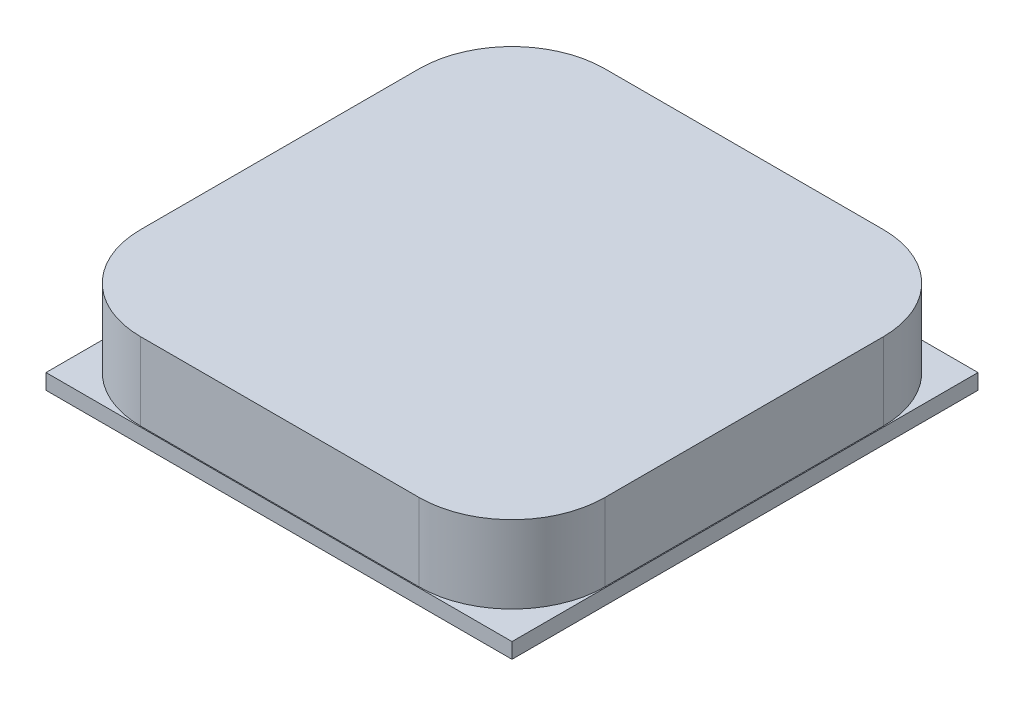
ISO-10303-21;
HEADER;
FILE_DESCRIPTION(('STEP AP214'),'2;1');
FILE_NAME('part.step','',(''),(''),'','','');
FILE_SCHEMA(('AUTOMOTIVE_DESIGN { 1 0 10303 214 1 1 1 1 }'));
ENDSEC;
DATA;
#1=APPLICATION_CONTEXT('core data for automotive mechanical design processes');
#2=APPLICATION_PROTOCOL_DEFINITION('international standard','automotive_design',2000,#1);
#3=PRODUCT_CONTEXT('',#1,'mechanical');
#4=PRODUCT('Part','Part','',(#3));
#5=PRODUCT_RELATED_PRODUCT_CATEGORY('part','',(#4));
#6=PRODUCT_DEFINITION_FORMATION('','',#4);
#7=PRODUCT_DEFINITION_CONTEXT('part definition',#1,'design');
#8=PRODUCT_DEFINITION('design','',#6,#7);
#9=PRODUCT_DEFINITION_SHAPE('','',#8);
#10=(LENGTH_UNIT() NAMED_UNIT(*) SI_UNIT(.MILLI.,.METRE.));
#11=(NAMED_UNIT(*) PLANE_ANGLE_UNIT() SI_UNIT($,.RADIAN.));
#12=(NAMED_UNIT(*) SI_UNIT($,.STERADIAN.) SOLID_ANGLE_UNIT());
#13=UNCERTAINTY_MEASURE_WITH_UNIT(LENGTH_MEASURE(1.E-05),#10,'distance_accuracy_value','');
#14=(GEOMETRIC_REPRESENTATION_CONTEXT(3) GLOBAL_UNCERTAINTY_ASSIGNED_CONTEXT((#13)) GLOBAL_UNIT_ASSIGNED_CONTEXT((#10,
#11,#12)) REPRESENTATION_CONTEXT('',''));
#15=CARTESIAN_POINT('',(0.,0.,0.));
#16=DIRECTION('',(0.,0.,1.));
#17=DIRECTION('',(1.,0.,0.));
#18=AXIS2_PLACEMENT_3D('',#15,#16,#17);
#19=CARTESIAN_POINT('',(0.,0.83,0.));
#20=DIRECTION('',(0.,-1.,0.));
#21=DIRECTION('',(0.,0.,-1.));
#22=AXIS2_PLACEMENT_3D('',#19,#20,#21);
#23=PLANE('',#22);
#24=DIRECTION('',(0.,0.,-1.));
#25=VECTOR('',#24,1.);
#26=CARTESIAN_POINT('',(12.55,0.83,12.55));
#27=LINE('',#26,#25);
#28=CARTESIAN_POINT('',(12.55,0.83,12.55));
#29=VERTEX_POINT('',#28);
#30=CARTESIAN_POINT('',(12.55,0.83,-12.55));
#31=VERTEX_POINT('',#30);
#32=EDGE_CURVE('E281',#29,#31,#27,.T.);
#33=ORIENTED_EDGE('',*,*,#32,.T.);
#34=DIRECTION('',(-1.,0.,0.));
#35=VECTOR('',#34,1.);
#36=CARTESIAN_POINT('',(-12.55,0.83,-12.55));
#37=LINE('',#36,#35);
#38=CARTESIAN_POINT('',(-12.55,0.83,-12.55));
#39=VERTEX_POINT('',#38);
#40=EDGE_CURVE('E284',#31,#39,#37,.T.);
#41=ORIENTED_EDGE('',*,*,#40,.T.);
#42=DIRECTION('',(0.,0.,1.));
#43=VECTOR('',#42,1.);
#44=CARTESIAN_POINT('',(-12.55,0.83,12.55));
#45=LINE('',#44,#43);
#46=CARTESIAN_POINT('',(-12.55,0.83,12.55));
#47=VERTEX_POINT('',#46);
#48=EDGE_CURVE('E287',#39,#47,#45,.T.);
#49=ORIENTED_EDGE('',*,*,#48,.T.);
#50=DIRECTION('',(1.,0.,0.));
#51=VECTOR('',#50,1.);
#52=CARTESIAN_POINT('',(-12.55,0.83,12.55));
#53=LINE('',#52,#51);
#54=EDGE_CURVE('E289',#47,#29,#53,.T.);
#55=ORIENTED_EDGE('',*,*,#54,.T.);
#56=EDGE_LOOP('',(#33,#41,#49,#55));
#57=FACE_BOUND('',#56,.T.);
#58=DIRECTION('',(0.,0.,-1.));
#59=VECTOR('',#58,1.);
#60=CARTESIAN_POINT('',(12.5,0.83,0.));
#61=LINE('',#60,#59);
#62=CARTESIAN_POINT('',(12.5,0.83,7.5));
#63=VERTEX_POINT('',#62);
#64=CARTESIAN_POINT('',(12.5,0.83,-7.5));
#65=VERTEX_POINT('',#64);
#66=EDGE_CURVE('E277',#63,#65,#61,.T.);
#67=ORIENTED_EDGE('',*,*,#66,.F.);
#68=CARTESIAN_POINT('',(7.5,0.83,7.5));
#69=DIRECTION('',(0.,-1.,0.));
#70=DIRECTION('',(0.,0.,-1.));
#71=AXIS2_PLACEMENT_3D('',#68,#69,#70);
#72=CIRCLE('',#71,5.);
#73=CARTESIAN_POINT('',(7.5,0.83,12.5));
#74=VERTEX_POINT('',#73);
#75=EDGE_CURVE('E342',#63,#74,#72,.T.);
#76=ORIENTED_EDGE('',*,*,#75,.T.);
#77=DIRECTION('',(1.,0.,0.));
#78=VECTOR('',#77,1.);
#79=CARTESIAN_POINT('',(0.,0.83,12.5));
#80=LINE('',#79,#78);
#81=CARTESIAN_POINT('',(-7.5,0.83,12.5));
#82=VERTEX_POINT('',#81);
#83=EDGE_CURVE('E268',#82,#74,#80,.T.);
#84=ORIENTED_EDGE('',*,*,#83,.F.);
#85=CARTESIAN_POINT('',(-7.5,0.83,7.5));
#86=DIRECTION('',(0.,-1.,0.));
#87=DIRECTION('',(0.,0.,-1.));
#88=AXIS2_PLACEMENT_3D('',#85,#86,#87);
#89=CIRCLE('',#88,5.);
#90=CARTESIAN_POINT('',(-12.5,0.83,7.5));
#91=VERTEX_POINT('',#90);
#92=EDGE_CURVE('E344',#82,#91,#89,.T.);
#93=ORIENTED_EDGE('',*,*,#92,.T.);
#94=DIRECTION('',(0.,0.,1.));
#95=VECTOR('',#94,1.);
#96=CARTESIAN_POINT('',(-12.5,0.83,0.));
#97=LINE('',#96,#95);
#98=CARTESIAN_POINT('',(-12.5,0.83,-7.5));
#99=VERTEX_POINT('',#98);
#100=EDGE_CURVE('E271',#99,#91,#97,.T.);
#101=ORIENTED_EDGE('',*,*,#100,.F.);
#102=CARTESIAN_POINT('',(-7.5,0.83,-7.5));
#103=DIRECTION('',(0.,-1.,0.));
#104=DIRECTION('',(0.,0.,-1.));
#105=AXIS2_PLACEMENT_3D('',#102,#103,#104);
#106=CIRCLE('',#105,5.);
#107=CARTESIAN_POINT('',(-7.5,0.83,-12.5));
#108=VERTEX_POINT('',#107);
#109=EDGE_CURVE('E338',#99,#108,#106,.T.);
#110=ORIENTED_EDGE('',*,*,#109,.T.);
#111=DIRECTION('',(-1.,0.,0.));
#112=VECTOR('',#111,1.);
#113=CARTESIAN_POINT('',(0.,0.83,-12.5));
#114=LINE('',#113,#112);
#115=CARTESIAN_POINT('',(7.5,0.83,-12.5));
#116=VERTEX_POINT('',#115);
#117=EDGE_CURVE('E274',#116,#108,#114,.T.);
#118=ORIENTED_EDGE('',*,*,#117,.F.);
#119=CARTESIAN_POINT('',(7.5,0.83,-7.5));
#120=DIRECTION('',(0.,-1.,0.));
#121=DIRECTION('',(0.,0.,-1.));
#122=AXIS2_PLACEMENT_3D('',#119,#120,#121);
#123=CIRCLE('',#122,5.);
#124=EDGE_CURVE('E340',#116,#65,#123,.T.);
#125=ORIENTED_EDGE('',*,*,#124,.T.);
#126=EDGE_LOOP('',(#67,#76,#84,#93,#101,#110,#118,#125));
#127=FACE_BOUND('',#126,.T.);
#128=ADVANCED_FACE('F42',(#57,#127),#23,.F.);
#129=CARTESIAN_POINT('',(12.55,0.83,12.55));
#130=DIRECTION('',(-1.,0.,0.));
#131=DIRECTION('',(0.,0.,1.));
#132=AXIS2_PLACEMENT_3D('',#129,#130,#131);
#133=PLANE('',#132);
#134=DIRECTION('',(0.,0.,-1.));
#135=VECTOR('',#134,1.);
#136=CARTESIAN_POINT('',(12.55,0.,12.55));
#137=LINE('',#136,#135);
#138=CARTESIAN_POINT('',(12.55,0.,12.55));
#139=VERTEX_POINT('',#138);
#140=CARTESIAN_POINT('',(12.55,0.,-12.55));
#141=VERTEX_POINT('',#140);
#142=EDGE_CURVE('E280',#139,#141,#137,.T.);
#143=ORIENTED_EDGE('',*,*,#142,.T.);
#144=DIRECTION('',(0.,-1.,0.));
#145=VECTOR('',#144,1.);
#146=CARTESIAN_POINT('',(12.55,0.83,-12.55));
#147=LINE('',#146,#145);
#148=EDGE_CURVE('E307',#31,#141,#147,.T.);
#149=ORIENTED_EDGE('',*,*,#148,.F.);
#150=ORIENTED_EDGE('',*,*,#32,.F.);
#151=DIRECTION('',(0.,-1.,0.));
#152=VECTOR('',#151,1.);
#153=CARTESIAN_POINT('',(12.55,0.83,12.55));
#154=LINE('',#153,#152);
#155=EDGE_CURVE('E291',#29,#139,#154,.T.);
#156=ORIENTED_EDGE('',*,*,#155,.T.);
#157=EDGE_LOOP('',(#143,#149,#150,#156));
#158=FACE_BOUND('',#157,.T.);
#159=ADVANCED_FACE('F393',(#158),#133,.F.);
#160=CARTESIAN_POINT('',(-12.55,0.83,-12.55));
#161=DIRECTION('',(0.,0.,1.));
#162=DIRECTION('',(1.,0.,0.));
#163=AXIS2_PLACEMENT_3D('',#160,#161,#162);
#164=PLANE('',#163);
#165=DIRECTION('',(-1.,0.,0.));
#166=VECTOR('',#165,1.);
#167=CARTESIAN_POINT('',(-12.55,0.,-12.55));
#168=LINE('',#167,#166);
#169=CARTESIAN_POINT('',(-12.55,0.,-12.55));
#170=VERTEX_POINT('',#169);
#171=EDGE_CURVE('E294',#141,#170,#168,.T.);
#172=ORIENTED_EDGE('',*,*,#171,.T.);
#173=DIRECTION('',(0.,-1.,0.));
#174=VECTOR('',#173,1.);
#175=CARTESIAN_POINT('',(-12.55,0.83,-12.55));
#176=LINE('',#175,#174);
#177=EDGE_CURVE('E304',#39,#170,#176,.T.);
#178=ORIENTED_EDGE('',*,*,#177,.F.);
#179=ORIENTED_EDGE('',*,*,#40,.F.);
#180=ORIENTED_EDGE('',*,*,#148,.T.);
#181=EDGE_LOOP('',(#172,#178,#179,#180));
#182=FACE_BOUND('',#181,.T.);
#183=ADVANCED_FACE('F399',(#182),#164,.F.);
#184=CARTESIAN_POINT('',(-12.55,0.83,12.55));
#185=DIRECTION('',(1.,0.,0.));
#186=DIRECTION('',(0.,0.,-1.));
#187=AXIS2_PLACEMENT_3D('',#184,#185,#186);
#188=PLANE('',#187);
#189=DIRECTION('',(0.,0.,1.));
#190=VECTOR('',#189,1.);
#191=CARTESIAN_POINT('',(-12.55,0.,12.55));
#192=LINE('',#191,#190);
#193=CARTESIAN_POINT('',(-12.55,0.,12.55));
#194=VERTEX_POINT('',#193);
#195=EDGE_CURVE('E296',#170,#194,#192,.T.);
#196=ORIENTED_EDGE('',*,*,#195,.T.);
#197=DIRECTION('',(0.,-1.,0.));
#198=VECTOR('',#197,1.);
#199=CARTESIAN_POINT('',(-12.55,0.83,12.55));
#200=LINE('',#199,#198);
#201=EDGE_CURVE('E301',#47,#194,#200,.T.);
#202=ORIENTED_EDGE('',*,*,#201,.F.);
#203=ORIENTED_EDGE('',*,*,#48,.F.);
#204=ORIENTED_EDGE('',*,*,#177,.T.);
#205=EDGE_LOOP('',(#196,#202,#203,#204));
#206=FACE_BOUND('',#205,.T.);
#207=ADVANCED_FACE('F412',(#206),#188,.F.);
#208=CARTESIAN_POINT('',(-12.55,0.83,12.55));
#209=DIRECTION('',(0.,0.,-1.));
#210=DIRECTION('',(-1.,0.,0.));
#211=AXIS2_PLACEMENT_3D('',#208,#209,#210);
#212=PLANE('',#211);
#213=DIRECTION('',(1.,0.,0.));
#214=VECTOR('',#213,1.);
#215=CARTESIAN_POINT('',(-12.55,0.,12.55));
#216=LINE('',#215,#214);
#217=EDGE_CURVE('E285',#194,#139,#216,.T.);
#218=ORIENTED_EDGE('',*,*,#217,.T.);
#219=ORIENTED_EDGE('',*,*,#155,.F.);
#220=ORIENTED_EDGE('',*,*,#54,.F.);
#221=ORIENTED_EDGE('',*,*,#201,.T.);
#222=EDGE_LOOP('',(#218,#219,#220,#221));
#223=FACE_BOUND('',#222,.T.);
#224=ADVANCED_FACE('F409',(#223),#212,.F.);
#225=CARTESIAN_POINT('',(0.,0.,0.));
#226=DIRECTION('',(0.,-1.,0.));
#227=DIRECTION('',(0.,0.,-1.));
#228=AXIS2_PLACEMENT_3D('',#225,#226,#227);
#229=PLANE('',#228);
#230=DIRECTION('',(0.,0.,1.));
#231=VECTOR('',#230,1.);
#232=CARTESIAN_POINT('',(8.,0.,0.));
#233=LINE('',#232,#231);
#234=CARTESIAN_POINT('',(8.,0.,-7.50000000000001));
#235=VERTEX_POINT('',#234);
#236=CARTESIAN_POINT('',(8.,0.,-1.5));
#237=VERTEX_POINT('',#236);
#238=EDGE_CURVE('E238',#235,#237,#233,.T.);
#239=ORIENTED_EDGE('',*,*,#238,.F.);
#240=DIRECTION('',(-1.,0.,0.));
#241=VECTOR('',#240,1.);
#242=CARTESIAN_POINT('',(0.,0.,-7.50000000000001));
#243=LINE('',#242,#241);
#244=CARTESIAN_POINT('',(-8.,0.,-7.50000000000001));
#245=VERTEX_POINT('',#244);
#246=EDGE_CURVE('E352',#235,#245,#243,.T.);
#247=ORIENTED_EDGE('',*,*,#246,.T.);
#248=DIRECTION('',(0.,0.,1.));
#249=VECTOR('',#248,1.);
#250=CARTESIAN_POINT('',(-8.,0.,0.));
#251=LINE('',#250,#249);
#252=CARTESIAN_POINT('',(-8.,0.,7.50000000000001));
#253=VERTEX_POINT('',#252);
#254=EDGE_CURVE('E240',#245,#253,#251,.T.);
#255=ORIENTED_EDGE('',*,*,#254,.T.);
#256=DIRECTION('',(1.,0.,0.));
#257=VECTOR('',#256,1.);
#258=CARTESIAN_POINT('',(8.,0.,7.50000000000001));
#259=LINE('',#258,#257);
#260=CARTESIAN_POINT('',(8.,0.,7.50000000000001));
#261=VERTEX_POINT('',#260);
#262=EDGE_CURVE('E349',#253,#261,#259,.T.);
#263=ORIENTED_EDGE('',*,*,#262,.T.);
#264=CARTESIAN_POINT('',(8.,0.,1.5));
#265=VERTEX_POINT('',#264);
#266=EDGE_CURVE('E221',#265,#261,#233,.T.);
#267=ORIENTED_EDGE('',*,*,#266,.F.);
#268=DIRECTION('',(-1.,0.,0.));
#269=VECTOR('',#268,1.);
#270=CARTESIAN_POINT('',(0.,0.,1.5));
#271=LINE('',#270,#269);
#272=CARTESIAN_POINT('',(5.,0.,1.5));
#273=VERTEX_POINT('',#272);
#274=EDGE_CURVE('E218',#265,#273,#271,.T.);
#275=ORIENTED_EDGE('',*,*,#274,.T.);
#276=DIRECTION('',(0.,0.,1.));
#277=VECTOR('',#276,1.);
#278=CARTESIAN_POINT('',(5.,0.,0.));
#279=LINE('',#278,#277);
#280=CARTESIAN_POINT('',(5.,0.,-1.5));
#281=VERTEX_POINT('',#280);
#282=EDGE_CURVE('E235',#281,#273,#279,.T.);
#283=ORIENTED_EDGE('',*,*,#282,.F.);
#284=DIRECTION('',(-1.,0.,0.));
#285=VECTOR('',#284,1.);
#286=CARTESIAN_POINT('',(0.,0.,-1.5));
#287=LINE('',#286,#285);
#288=EDGE_CURVE('E208',#237,#281,#287,.T.);
#289=ORIENTED_EDGE('',*,*,#288,.F.);
#290=EDGE_LOOP('',(#239,#247,#255,#263,#267,#275,#283,#289));
#291=FACE_BOUND('',#290,.T.);
#292=ORIENTED_EDGE('',*,*,#142,.F.);
#293=ORIENTED_EDGE('',*,*,#217,.F.);
#294=ORIENTED_EDGE('',*,*,#195,.F.);
#295=ORIENTED_EDGE('',*,*,#171,.F.);
#296=EDGE_LOOP('',(#292,#293,#294,#295));
#297=FACE_BOUND('',#296,.T.);
#298=ADVANCED_FACE('F375',(#291,#297),#229,.T.);
#299=CARTESIAN_POINT('',(12.5,5.,12.5));
#300=DIRECTION('',(-1.,0.,0.));
#301=DIRECTION('',(0.,0.,1.));
#302=AXIS2_PLACEMENT_3D('',#299,#300,#301);
#303=PLANE('',#302);
#304=ORIENTED_EDGE('',*,*,#66,.T.);
#305=DIRECTION('',(0.,-1.,0.));
#306=VECTOR('',#305,1.);
#307=CARTESIAN_POINT('',(12.5,5.,-7.5));
#308=LINE('',#307,#306);
#309=CARTESIAN_POINT('',(12.5,5.,-7.5));
#310=VERTEX_POINT('',#309);
#311=EDGE_CURVE('E331',#65,#310,#308,.F.);
#312=ORIENTED_EDGE('',*,*,#311,.T.);
#313=DIRECTION('',(0.,0.,-1.));
#314=VECTOR('',#313,1.);
#315=CARTESIAN_POINT('',(12.5,5.,12.5));
#316=LINE('',#315,#314);
#317=CARTESIAN_POINT('',(12.5,5.,7.5));
#318=VERTEX_POINT('',#317);
#319=EDGE_CURVE('E243',#318,#310,#316,.T.);
#320=ORIENTED_EDGE('',*,*,#319,.F.);
#321=DIRECTION('',(0.,-1.,0.));
#322=VECTOR('',#321,1.);
#323=CARTESIAN_POINT('',(12.5,5.,7.5));
#324=LINE('',#323,#322);
#325=EDGE_CURVE('E328',#318,#63,#324,.T.);
#326=ORIENTED_EDGE('',*,*,#325,.T.);
#327=EDGE_LOOP('',(#304,#312,#320,#326));
#328=FACE_BOUND('',#327,.T.);
#329=ADVANCED_FACE('F405',(#328),#303,.F.);
#330=CARTESIAN_POINT('',(-12.5,5.,-12.5));
#331=DIRECTION('',(0.,0.,1.));
#332=DIRECTION('',(1.,0.,0.));
#333=AXIS2_PLACEMENT_3D('',#330,#331,#332);
#334=PLANE('',#333);
#335=ORIENTED_EDGE('',*,*,#117,.T.);
#336=DIRECTION('',(0.,-1.,0.));
#337=VECTOR('',#336,1.);
#338=CARTESIAN_POINT('',(-7.5,5.,-12.5));
#339=LINE('',#338,#337);
#340=CARTESIAN_POINT('',(-7.5,5.,-12.5));
#341=VERTEX_POINT('',#340);
#342=EDGE_CURVE('E318',#108,#341,#339,.F.);
#343=ORIENTED_EDGE('',*,*,#342,.T.);
#344=DIRECTION('',(-1.,0.,0.));
#345=VECTOR('',#344,1.);
#346=CARTESIAN_POINT('',(-12.5,5.,-12.5));
#347=LINE('',#346,#345);
#348=CARTESIAN_POINT('',(7.5,5.,-12.5));
#349=VERTEX_POINT('',#348);
#350=EDGE_CURVE('E259',#349,#341,#347,.T.);
#351=ORIENTED_EDGE('',*,*,#350,.F.);
#352=DIRECTION('',(0.,-1.,0.));
#353=VECTOR('',#352,1.);
#354=CARTESIAN_POINT('',(7.5,5.,-12.5));
#355=LINE('',#354,#353);
#356=EDGE_CURVE('E315',#349,#116,#355,.T.);
#357=ORIENTED_EDGE('',*,*,#356,.T.);
#358=EDGE_LOOP('',(#335,#343,#351,#357));
#359=FACE_BOUND('',#358,.T.);
#360=ADVANCED_FACE('F466',(#359),#334,.F.);
#361=CARTESIAN_POINT('',(-12.5,5.,12.5));
#362=DIRECTION('',(1.,0.,0.));
#363=DIRECTION('',(0.,0.,-1.));
#364=AXIS2_PLACEMENT_3D('',#361,#362,#363);
#365=PLANE('',#364);
#366=DIRECTION('',(0.,0.,1.));
#367=VECTOR('',#366,1.);
#368=CARTESIAN_POINT('',(-12.5,5.,12.5));
#369=LINE('',#368,#367);
#370=CARTESIAN_POINT('',(-12.5,5.,-7.5));
#371=VERTEX_POINT('',#370);
#372=CARTESIAN_POINT('',(-12.5,5.,7.5));
#373=VERTEX_POINT('',#372);
#374=EDGE_CURVE('E262',#371,#373,#369,.T.);
#375=ORIENTED_EDGE('',*,*,#374,.F.);
#376=DIRECTION('',(0.,-1.,0.));
#377=VECTOR('',#376,1.);
#378=CARTESIAN_POINT('',(-12.5,5.,-7.5));
#379=LINE('',#378,#377);
#380=EDGE_CURVE('E312',#371,#99,#379,.T.);
#381=ORIENTED_EDGE('',*,*,#380,.T.);
#382=ORIENTED_EDGE('',*,*,#100,.T.);
#383=DIRECTION('',(0.,-1.,0.));
#384=VECTOR('',#383,1.);
#385=CARTESIAN_POINT('',(-12.5,5.,7.5));
#386=LINE('',#385,#384);
#387=EDGE_CURVE('E310',#91,#373,#386,.F.);
#388=ORIENTED_EDGE('',*,*,#387,.T.);
#389=EDGE_LOOP('',(#375,#381,#382,#388));
#390=FACE_BOUND('',#389,.T.);
#391=ADVANCED_FACE('F471',(#390),#365,.F.);
#392=CARTESIAN_POINT('',(-12.5,5.,12.5));
#393=DIRECTION('',(0.,0.,-1.));
#394=DIRECTION('',(-1.,0.,0.));
#395=AXIS2_PLACEMENT_3D('',#392,#393,#394);
#396=PLANE('',#395);
#397=ORIENTED_EDGE('',*,*,#83,.T.);
#398=DIRECTION('',(0.,-1.,0.));
#399=VECTOR('',#398,1.);
#400=CARTESIAN_POINT('',(7.5,5.,12.5));
#401=LINE('',#400,#399);
#402=CARTESIAN_POINT('',(7.5,5.,12.5));
#403=VERTEX_POINT('',#402);
#404=EDGE_CURVE('E336',#74,#403,#401,.F.);
#405=ORIENTED_EDGE('',*,*,#404,.T.);
#406=DIRECTION('',(1.,0.,0.));
#407=VECTOR('',#406,1.);
#408=CARTESIAN_POINT('',(-12.5,5.,12.5));
#409=LINE('',#408,#407);
#410=CARTESIAN_POINT('',(-7.5,5.,12.5));
#411=VERTEX_POINT('',#410);
#412=EDGE_CURVE('E265',#411,#403,#409,.T.);
#413=ORIENTED_EDGE('',*,*,#412,.F.);
#414=DIRECTION('',(0.,-1.,0.));
#415=VECTOR('',#414,1.);
#416=CARTESIAN_POINT('',(-7.5,5.,12.5));
#417=LINE('',#416,#415);
#418=EDGE_CURVE('E333',#411,#82,#417,.T.);
#419=ORIENTED_EDGE('',*,*,#418,.T.);
#420=EDGE_LOOP('',(#397,#405,#413,#419));
#421=FACE_BOUND('',#420,.T.);
#422=ADVANCED_FACE('F453',(#421),#396,.F.);
#423=CARTESIAN_POINT('',(0.,5.,0.));
#424=DIRECTION('',(0.,-1.,0.));
#425=DIRECTION('',(0.,0.,-1.));
#426=AXIS2_PLACEMENT_3D('',#423,#424,#425);
#427=PLANE('',#426);
#428=ORIENTED_EDGE('',*,*,#350,.T.);
#429=CARTESIAN_POINT('',(-7.5,5.,-7.5));
#430=DIRECTION('',(0.,-1.,0.));
#431=DIRECTION('',(0.,0.,-1.));
#432=AXIS2_PLACEMENT_3D('',#429,#430,#431);
#433=CIRCLE('',#432,5.);
#434=EDGE_CURVE('E326',#341,#371,#433,.F.);
#435=ORIENTED_EDGE('',*,*,#434,.T.);
#436=ORIENTED_EDGE('',*,*,#374,.T.);
#437=CARTESIAN_POINT('',(-7.5,5.,7.5));
#438=DIRECTION('',(0.,-1.,0.));
#439=DIRECTION('',(0.,0.,-1.));
#440=AXIS2_PLACEMENT_3D('',#437,#438,#439);
#441=CIRCLE('',#440,5.);
#442=EDGE_CURVE('E320',#373,#411,#441,.F.);
#443=ORIENTED_EDGE('',*,*,#442,.T.);
#444=ORIENTED_EDGE('',*,*,#412,.T.);
#445=CARTESIAN_POINT('',(7.5,5.,7.5));
#446=DIRECTION('',(0.,-1.,0.));
#447=DIRECTION('',(0.,0.,-1.));
#448=AXIS2_PLACEMENT_3D('',#445,#446,#447);
#449=CIRCLE('',#448,5.);
#450=EDGE_CURVE('E322',#403,#318,#449,.F.);
#451=ORIENTED_EDGE('',*,*,#450,.T.);
#452=ORIENTED_EDGE('',*,*,#319,.T.);
#453=CARTESIAN_POINT('',(7.5,5.,-7.5));
#454=DIRECTION('',(0.,-1.,0.));
#455=DIRECTION('',(0.,0.,-1.));
#456=AXIS2_PLACEMENT_3D('',#453,#454,#455);
#457=CIRCLE('',#456,5.);
#458=EDGE_CURVE('E324',#310,#349,#457,.F.);
#459=ORIENTED_EDGE('',*,*,#458,.T.);
#460=EDGE_LOOP('',(#428,#435,#436,#443,#444,#451,#452,#459));
#461=FACE_BOUND('',#460,.T.);
#462=ADVANCED_FACE('F424',(#461),#427,.F.);
#463=CARTESIAN_POINT('',(-7.5,5.,-7.5));
#464=DIRECTION('',(0.,-1.,0.));
#465=DIRECTION('',(0.,0.,-1.));
#466=AXIS2_PLACEMENT_3D('',#463,#464,#465);
#467=CYLINDRICAL_SURFACE('',#466,5.);
#468=ORIENTED_EDGE('',*,*,#434,.F.);
#469=ORIENTED_EDGE('',*,*,#342,.F.);
#470=ORIENTED_EDGE('',*,*,#109,.F.);
#471=ORIENTED_EDGE('',*,*,#380,.F.);
#472=EDGE_LOOP('',(#468,#469,#470,#471));
#473=FACE_BOUND('',#472,.T.);
#474=ADVANCED_FACE('F420',(#473),#467,.T.);
#475=CARTESIAN_POINT('',(7.5,5.,-7.5));
#476=DIRECTION('',(0.,-1.,0.));
#477=DIRECTION('',(0.,0.,-1.));
#478=AXIS2_PLACEMENT_3D('',#475,#476,#477);
#479=CYLINDRICAL_SURFACE('',#478,5.);
#480=ORIENTED_EDGE('',*,*,#458,.F.);
#481=ORIENTED_EDGE('',*,*,#311,.F.);
#482=ORIENTED_EDGE('',*,*,#124,.F.);
#483=ORIENTED_EDGE('',*,*,#356,.F.);
#484=EDGE_LOOP('',(#480,#481,#482,#483));
#485=FACE_BOUND('',#484,.T.);
#486=ADVANCED_FACE('F423',(#485),#479,.T.);
#487=CARTESIAN_POINT('',(7.5,5.,7.5));
#488=DIRECTION('',(0.,-1.,0.));
#489=DIRECTION('',(0.,0.,-1.));
#490=AXIS2_PLACEMENT_3D('',#487,#488,#489);
#491=CYLINDRICAL_SURFACE('',#490,5.);
#492=ORIENTED_EDGE('',*,*,#450,.F.);
#493=ORIENTED_EDGE('',*,*,#404,.F.);
#494=ORIENTED_EDGE('',*,*,#75,.F.);
#495=ORIENTED_EDGE('',*,*,#325,.F.);
#496=EDGE_LOOP('',(#492,#493,#494,#495));
#497=FACE_BOUND('',#496,.T.);
#498=ADVANCED_FACE('F428',(#497),#491,.T.);
#499=CARTESIAN_POINT('',(-7.5,5.,7.5));
#500=DIRECTION('',(0.,-1.,0.));
#501=DIRECTION('',(0.,0.,-1.));
#502=AXIS2_PLACEMENT_3D('',#499,#500,#501);
#503=CYLINDRICAL_SURFACE('',#502,5.);
#504=ORIENTED_EDGE('',*,*,#442,.F.);
#505=ORIENTED_EDGE('',*,*,#387,.F.);
#506=ORIENTED_EDGE('',*,*,#92,.F.);
#507=ORIENTED_EDGE('',*,*,#418,.F.);
#508=EDGE_LOOP('',(#504,#505,#506,#507));
#509=FACE_BOUND('',#508,.T.);
#510=ADVANCED_FACE('F432',(#509),#503,.T.);
#511=CARTESIAN_POINT('',(5.,-2.4,0.));
#512=DIRECTION('',(-1.,0.,0.));
#513=DIRECTION('',(0.,0.,1.));
#514=AXIS2_PLACEMENT_3D('',#511,#512,#513);
#515=PLANE('',#514);
#516=ORIENTED_EDGE('',*,*,#282,.T.);
#517=DIRECTION('',(0.,1.,0.));
#518=VECTOR('',#517,1.);
#519=CARTESIAN_POINT('',(5.,-2.4,1.5));
#520=LINE('',#519,#518);
#521=CARTESIAN_POINT('',(5.,-2.4,1.5));
#522=VERTEX_POINT('',#521);
#523=EDGE_CURVE('E216',#522,#273,#520,.T.);
#524=ORIENTED_EDGE('',*,*,#523,.F.);
#525=DIRECTION('',(0.,0.,1.));
#526=VECTOR('',#525,1.);
#527=CARTESIAN_POINT('',(5.,-2.4,0.));
#528=LINE('',#527,#526);
#529=CARTESIAN_POINT('',(5.,-2.4,-1.5));
#530=VERTEX_POINT('',#529);
#531=EDGE_CURVE('E196',#530,#522,#528,.T.);
#532=ORIENTED_EDGE('',*,*,#531,.F.);
#533=DIRECTION('',(0.,1.,0.));
#534=VECTOR('',#533,1.);
#535=CARTESIAN_POINT('',(5.,-2.4,-1.5));
#536=LINE('',#535,#534);
#537=EDGE_CURVE('E205',#530,#281,#536,.T.);
#538=ORIENTED_EDGE('',*,*,#537,.T.);
#539=EDGE_LOOP('',(#516,#524,#532,#538));
#540=FACE_BOUND('',#539,.T.);
#541=ADVANCED_FACE('F214',(#540),#515,.F.);
#542=CARTESIAN_POINT('',(0.,-2.4,1.5));
#543=DIRECTION('',(0.,0.,-1.));
#544=DIRECTION('',(-1.,0.,0.));
#545=AXIS2_PLACEMENT_3D('',#542,#543,#544);
#546=PLANE('',#545);
#547=ORIENTED_EDGE('',*,*,#274,.F.);
#548=DIRECTION('',(0.,1.,0.));
#549=VECTOR('',#548,1.);
#550=CARTESIAN_POINT('',(8.,-2.4,1.5));
#551=LINE('',#550,#549);
#552=CARTESIAN_POINT('',(8.,-2.4,1.5));
#553=VERTEX_POINT('',#552);
#554=EDGE_CURVE('E244',#553,#265,#551,.T.);
#555=ORIENTED_EDGE('',*,*,#554,.F.);
#556=DIRECTION('',(-1.,0.,0.));
#557=VECTOR('',#556,1.);
#558=CARTESIAN_POINT('',(0.,-2.4,1.5));
#559=LINE('',#558,#557);
#560=EDGE_CURVE('E212',#553,#522,#559,.T.);
#561=ORIENTED_EDGE('',*,*,#560,.T.);
#562=ORIENTED_EDGE('',*,*,#523,.T.);
#563=EDGE_LOOP('',(#547,#555,#561,#562));
#564=FACE_BOUND('',#563,.T.);
#565=ADVANCED_FACE('F380',(#564),#546,.T.);
#566=CARTESIAN_POINT('',(8.,-2.4,0.));
#567=DIRECTION('',(-1.,0.,0.));
#568=DIRECTION('',(0.,0.,1.));
#569=AXIS2_PLACEMENT_3D('',#566,#567,#568);
#570=PLANE('',#569);
#571=ORIENTED_EDGE('',*,*,#266,.T.);
#572=DIRECTION('',(0.,0.707106781186545,0.70710678118655));
#573=VECTOR('',#572,1.);
#574=CARTESIAN_POINT('',(8.,-4.94999999999999,2.54999999999998));
#575=LINE('',#574,#573);
#576=CARTESIAN_POINT('',(8.,-0.500000000000004,7.));
#577=VERTEX_POINT('',#576);
#578=EDGE_CURVE('E51',#261,#577,#575,.F.);
#579=ORIENTED_EDGE('',*,*,#578,.T.);
#580=DIRECTION('',(0.,1.,0.));
#581=VECTOR('',#580,1.);
#582=CARTESIAN_POINT('',(8.,-2.4,7.));
#583=LINE('',#582,#581);
#584=CARTESIAN_POINT('',(8.,-2.4,7.));
#585=VERTEX_POINT('',#584);
#586=EDGE_CURVE('E246',#585,#577,#583,.T.);
#587=ORIENTED_EDGE('',*,*,#586,.F.);
#588=DIRECTION('',(0.,0.,1.));
#589=VECTOR('',#588,1.);
#590=CARTESIAN_POINT('',(8.,-2.4,0.));
#591=LINE('',#590,#589);
#592=EDGE_CURVE('E226',#553,#585,#591,.T.);
#593=ORIENTED_EDGE('',*,*,#592,.F.);
#594=ORIENTED_EDGE('',*,*,#554,.T.);
#595=EDGE_LOOP('',(#571,#579,#587,#593,#594));
#596=FACE_BOUND('',#595,.T.);
#597=ADVANCED_FACE('F383',(#596),#570,.F.);
#598=CARTESIAN_POINT('',(0.,-2.4,7.));
#599=DIRECTION('',(0.,0.,1.));
#600=DIRECTION('',(1.,0.,0.));
#601=AXIS2_PLACEMENT_3D('',#598,#599,#600);
#602=PLANE('',#601);
#603=ORIENTED_EDGE('',*,*,#586,.T.);
#604=DIRECTION('',(-1.,0.,0.));
#605=VECTOR('',#604,1.);
#606=CARTESIAN_POINT('',(-8.,-0.500000000000004,7.));
#607=LINE('',#606,#605);
#608=CARTESIAN_POINT('',(-8.,-0.500000000000004,7.));
#609=VERTEX_POINT('',#608);
#610=EDGE_CURVE('E64',#577,#609,#607,.T.);
#611=ORIENTED_EDGE('',*,*,#610,.T.);
#612=DIRECTION('',(0.,1.,0.));
#613=VECTOR('',#612,1.);
#614=CARTESIAN_POINT('',(-8.,-2.4,7.));
#615=LINE('',#614,#613);
#616=CARTESIAN_POINT('',(-8.,-2.4,7.));
#617=VERTEX_POINT('',#616);
#618=EDGE_CURVE('E248',#617,#609,#615,.T.);
#619=ORIENTED_EDGE('',*,*,#618,.F.);
#620=DIRECTION('',(1.,0.,0.));
#621=VECTOR('',#620,1.);
#622=CARTESIAN_POINT('',(0.,-2.4,7.));
#623=LINE('',#622,#621);
#624=EDGE_CURVE('E231',#617,#585,#623,.T.);
#625=ORIENTED_EDGE('',*,*,#624,.T.);
#626=EDGE_LOOP('',(#603,#611,#619,#625));
#627=FACE_BOUND('',#626,.T.);
#628=ADVANCED_FACE('F384',(#627),#602,.T.);
#629=CARTESIAN_POINT('',(-8.,-2.4,0.));
#630=DIRECTION('',(-1.,0.,0.));
#631=DIRECTION('',(0.,0.,1.));
#632=AXIS2_PLACEMENT_3D('',#629,#630,#631);
#633=PLANE('',#632);
#634=ORIENTED_EDGE('',*,*,#254,.F.);
#635=DIRECTION('',(0.,-0.707106781186544,0.707106781186552));
#636=VECTOR('',#635,1.);
#637=CARTESIAN_POINT('',(-8.,-0.500000000000003,-7.));
#638=LINE('',#637,#636);
#639=CARTESIAN_POINT('',(-8.,-0.500000000000003,-7.));
#640=VERTEX_POINT('',#639);
#641=EDGE_CURVE('E359',#245,#640,#638,.T.);
#642=ORIENTED_EDGE('',*,*,#641,.T.);
#643=DIRECTION('',(0.,1.,0.));
#644=VECTOR('',#643,1.);
#645=CARTESIAN_POINT('',(-8.,-2.4,-7.));
#646=LINE('',#645,#644);
#647=CARTESIAN_POINT('',(-8.,-2.4,-7.));
#648=VERTEX_POINT('',#647);
#649=EDGE_CURVE('E250',#648,#640,#646,.T.);
#650=ORIENTED_EDGE('',*,*,#649,.F.);
#651=DIRECTION('',(0.,0.,1.));
#652=VECTOR('',#651,1.);
#653=CARTESIAN_POINT('',(-8.,-2.4,0.));
#654=LINE('',#653,#652);
#655=EDGE_CURVE('E228',#648,#617,#654,.T.);
#656=ORIENTED_EDGE('',*,*,#655,.T.);
#657=ORIENTED_EDGE('',*,*,#618,.T.);
#658=DIRECTION('',(0.,-0.707106781186545,-0.70710678118655));
#659=VECTOR('',#658,1.);
#660=CARTESIAN_POINT('',(-8.,0.,7.50000000000001));
#661=LINE('',#660,#659);
#662=EDGE_CURVE('E11',#609,#253,#661,.F.);
#663=ORIENTED_EDGE('',*,*,#662,.T.);
#664=EDGE_LOOP('',(#634,#642,#650,#656,#657,#663));
#665=FACE_BOUND('',#664,.T.);
#666=ADVANCED_FACE('F362',(#665),#633,.T.);
#667=CARTESIAN_POINT('',(0.,-2.4,-7.));
#668=DIRECTION('',(0.,0.,1.));
#669=DIRECTION('',(1.,0.,0.));
#670=AXIS2_PLACEMENT_3D('',#667,#668,#669);
#671=PLANE('',#670);
#672=ORIENTED_EDGE('',*,*,#649,.T.);
#673=DIRECTION('',(1.,0.,0.));
#674=VECTOR('',#673,1.);
#675=CARTESIAN_POINT('',(0.,-0.500000000000003,-7.));
#676=LINE('',#675,#674);
#677=CARTESIAN_POINT('',(8.,-0.500000000000003,-7.));
#678=VERTEX_POINT('',#677);
#679=EDGE_CURVE('E346',#640,#678,#676,.T.);
#680=ORIENTED_EDGE('',*,*,#679,.T.);
#681=DIRECTION('',(0.,1.,0.));
#682=VECTOR('',#681,1.);
#683=CARTESIAN_POINT('',(8.,-2.4,-7.));
#684=LINE('',#683,#682);
#685=CARTESIAN_POINT('',(8.,-2.4,-7.));
#686=VERTEX_POINT('',#685);
#687=EDGE_CURVE('E253',#686,#678,#684,.T.);
#688=ORIENTED_EDGE('',*,*,#687,.F.);
#689=DIRECTION('',(1.,0.,0.));
#690=VECTOR('',#689,1.);
#691=CARTESIAN_POINT('',(0.,-2.4,-7.));
#692=LINE('',#691,#690);
#693=EDGE_CURVE('E225',#648,#686,#692,.T.);
#694=ORIENTED_EDGE('',*,*,#693,.F.);
#695=EDGE_LOOP('',(#672,#680,#688,#694));
#696=FACE_BOUND('',#695,.T.);
#697=ADVANCED_FACE('F368',(#696),#671,.F.);
#698=ORIENTED_EDGE('',*,*,#238,.T.);
#699=DIRECTION('',(0.,1.,0.));
#700=VECTOR('',#699,1.);
#701=CARTESIAN_POINT('',(8.,-2.4,-1.5));
#702=LINE('',#701,#700);
#703=CARTESIAN_POINT('',(8.,-2.4,-1.5));
#704=VERTEX_POINT('',#703);
#705=EDGE_CURVE('E211',#704,#237,#702,.T.);
#706=ORIENTED_EDGE('',*,*,#705,.F.);
#707=EDGE_CURVE('E199',#686,#704,#591,.T.);
#708=ORIENTED_EDGE('',*,*,#707,.F.);
#709=ORIENTED_EDGE('',*,*,#687,.T.);
#710=DIRECTION('',(0.,0.707106781186544,-0.707106781186552));
#711=VECTOR('',#710,1.);
#712=CARTESIAN_POINT('',(8.,-4.94999999999999,-2.54999999999996));
#713=LINE('',#712,#711);
#714=EDGE_CURVE('E356',#678,#235,#713,.T.);
#715=ORIENTED_EDGE('',*,*,#714,.T.);
#716=EDGE_LOOP('',(#698,#706,#708,#709,#715));
#717=FACE_BOUND('',#716,.T.);
#718=ADVANCED_FACE('F373',(#717),#570,.F.);
#719=CARTESIAN_POINT('',(0.,-2.4,-1.5));
#720=DIRECTION('',(0.,0.,-1.));
#721=DIRECTION('',(-1.,0.,0.));
#722=AXIS2_PLACEMENT_3D('',#719,#720,#721);
#723=PLANE('',#722);
#724=ORIENTED_EDGE('',*,*,#288,.T.);
#725=ORIENTED_EDGE('',*,*,#537,.F.);
#726=DIRECTION('',(-1.,0.,0.));
#727=VECTOR('',#726,1.);
#728=CARTESIAN_POINT('',(0.,-2.4,-1.5));
#729=LINE('',#728,#727);
#730=EDGE_CURVE('E191',#704,#530,#729,.T.);
#731=ORIENTED_EDGE('',*,*,#730,.F.);
#732=ORIENTED_EDGE('',*,*,#705,.T.);
#733=EDGE_LOOP('',(#724,#725,#731,#732));
#734=FACE_BOUND('',#733,.T.);
#735=ADVANCED_FACE('F206',(#734),#723,.F.);
#736=CARTESIAN_POINT('',(0.,-2.4,0.));
#737=DIRECTION('',(0.,1.,0.));
#738=DIRECTION('',(0.,0.,1.));
#739=AXIS2_PLACEMENT_3D('',#736,#737,#738);
#740=PLANE('',#739);
#741=ORIENTED_EDGE('',*,*,#531,.T.);
#742=ORIENTED_EDGE('',*,*,#560,.F.);
#743=ORIENTED_EDGE('',*,*,#592,.T.);
#744=ORIENTED_EDGE('',*,*,#624,.F.);
#745=ORIENTED_EDGE('',*,*,#655,.F.);
#746=ORIENTED_EDGE('',*,*,#693,.T.);
#747=ORIENTED_EDGE('',*,*,#707,.T.);
#748=ORIENTED_EDGE('',*,*,#730,.T.);
#749=EDGE_LOOP('',(#741,#742,#743,#744,#745,#746,#747,#748));
#750=FACE_BOUND('',#749,.T.);
#751=ADVANCED_FACE('F193',(#750),#740,.F.);
#752=CARTESIAN_POINT('',(0.,-0.500000000000003,-7.));
#753=DIRECTION('',(0.,0.707106781186552,0.707106781186544));
#754=DIRECTION('',(1.,0.,0.));
#755=AXIS2_PLACEMENT_3D('',#752,#753,#754);
#756=PLANE('',#755);
#757=ORIENTED_EDGE('',*,*,#641,.F.);
#758=ORIENTED_EDGE('',*,*,#246,.F.);
#759=ORIENTED_EDGE('',*,*,#714,.F.);
#760=ORIENTED_EDGE('',*,*,#679,.F.);
#761=EDGE_LOOP('',(#757,#758,#759,#760));
#762=FACE_BOUND('',#761,.T.);
#763=ADVANCED_FACE('F371',(#762),#756,.F.);
#764=CARTESIAN_POINT('',(0.,0.,7.50000000000001));
#765=DIRECTION('',(0.,-0.70710678118655,0.707106781186545));
#766=DIRECTION('',(-1.,0.,0.));
#767=AXIS2_PLACEMENT_3D('',#764,#765,#766);
#768=PLANE('',#767);
#769=ORIENTED_EDGE('',*,*,#662,.F.);
#770=ORIENTED_EDGE('',*,*,#610,.F.);
#771=ORIENTED_EDGE('',*,*,#578,.F.);
#772=ORIENTED_EDGE('',*,*,#262,.F.);
#773=EDGE_LOOP('',(#769,#770,#771,#772));
#774=FACE_BOUND('',#773,.T.);
#775=ADVANCED_FACE('F45',(#774),#768,.T.);
#776=CLOSED_SHELL('',(#128,#159,#183,#207,#224,#298,#329,#360,#391,#422,#462,#474,#486,#498,
#510,#541,#565,#597,#628,#666,#697,#718,#735,#751,#763,#775));
#777=MANIFOLD_SOLID_BREP('B2',#776);
#778=ADVANCED_BREP_SHAPE_REPRESENTATION('',(#18,#777),#14);
#779=SHAPE_DEFINITION_REPRESENTATION(#9,#778);
ENDSEC;
END-ISO-10303-21;
